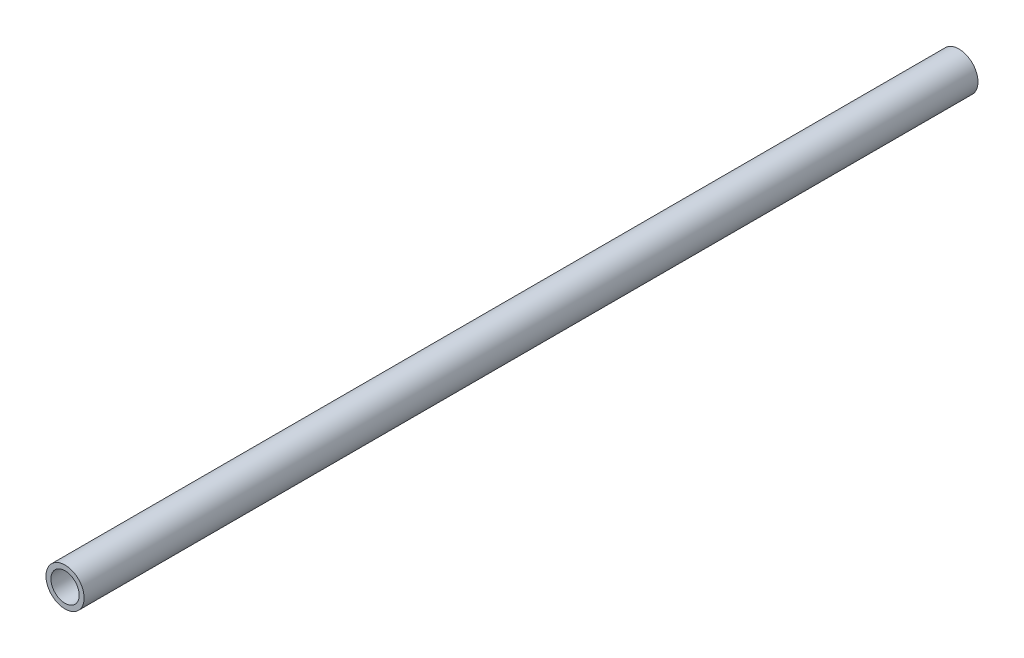
ISO-10303-21;
HEADER;
FILE_DESCRIPTION(('STEP AP214'),'2;1');
FILE_NAME('part.step','',(''),(''),'','','');
FILE_SCHEMA(('AUTOMOTIVE_DESIGN { 1 0 10303 214 1 1 1 1 }'));
ENDSEC;
DATA;
#1=APPLICATION_CONTEXT('core data for automotive mechanical design processes');
#2=APPLICATION_PROTOCOL_DEFINITION('international standard','automotive_design',2000,#1);
#3=PRODUCT_CONTEXT('',#1,'mechanical');
#4=PRODUCT('Part','Part','',(#3));
#5=PRODUCT_RELATED_PRODUCT_CATEGORY('part','',(#4));
#6=PRODUCT_DEFINITION_FORMATION('','',#4);
#7=PRODUCT_DEFINITION_CONTEXT('part definition',#1,'design');
#8=PRODUCT_DEFINITION('design','',#6,#7);
#9=PRODUCT_DEFINITION_SHAPE('','',#8);
#10=(LENGTH_UNIT() NAMED_UNIT(*) SI_UNIT(.MILLI.,.METRE.));
#11=(NAMED_UNIT(*) PLANE_ANGLE_UNIT() SI_UNIT($,.RADIAN.));
#12=(NAMED_UNIT(*) SI_UNIT($,.STERADIAN.) SOLID_ANGLE_UNIT());
#13=UNCERTAINTY_MEASURE_WITH_UNIT(LENGTH_MEASURE(1.E-05),#10,'distance_accuracy_value','');
#14=(GEOMETRIC_REPRESENTATION_CONTEXT(3) GLOBAL_UNCERTAINTY_ASSIGNED_CONTEXT((#13)) GLOBAL_UNIT_ASSIGNED_CONTEXT((#10,
#11,#12)) REPRESENTATION_CONTEXT('',''));
#15=CARTESIAN_POINT('',(0.,0.,0.));
#16=DIRECTION('',(0.,0.,1.));
#17=DIRECTION('',(1.,0.,0.));
#18=AXIS2_PLACEMENT_3D('',#15,#16,#17);
#19=CARTESIAN_POINT('',(0.,0.,250.));
#20=DIRECTION('',(0.,0.,1.));
#21=DIRECTION('',(1.,0.,0.));
#22=AXIS2_PLACEMENT_3D('',#19,#20,#21);
#23=PLANE('',#22);
#24=CARTESIAN_POINT('',(0.,0.,250.));
#25=DIRECTION('',(0.,0.,1.));
#26=DIRECTION('',(1.,0.,0.));
#27=AXIS2_PLACEMENT_3D('',#24,#25,#26);
#28=CIRCLE('',#27,10.668);
#29=CARTESIAN_POINT('',(10.668,0.,250.));
#30=VERTEX_POINT('',#29);
#31=EDGE_CURVE('E11',#30,#30,#28,.T.);
#32=ORIENTED_EDGE('',*,*,#31,.T.);
#33=EDGE_LOOP('',(#32));
#34=FACE_BOUND('',#33,.T.);
#35=CARTESIAN_POINT('',(0.,0.,250.));
#36=DIRECTION('',(0.,0.,1.));
#37=DIRECTION('',(1.,0.,0.));
#38=AXIS2_PLACEMENT_3D('',#35,#36,#37);
#39=CIRCLE('',#38,7.8994);
#40=CARTESIAN_POINT('',(7.8994,0.,250.));
#41=VERTEX_POINT('',#40);
#42=EDGE_CURVE('E48',#41,#41,#39,.T.);
#43=ORIENTED_EDGE('',*,*,#42,.F.);
#44=EDGE_LOOP('',(#43));
#45=FACE_BOUND('',#44,.T.);
#46=ADVANCED_FACE('F37',(#34,#45),#23,.T.);
#47=CARTESIAN_POINT('',(0.,0.,-250.));
#48=DIRECTION('',(0.,0.,1.));
#49=DIRECTION('',(1.,0.,0.));
#50=AXIS2_PLACEMENT_3D('',#47,#48,#49);
#51=PLANE('',#50);
#52=CARTESIAN_POINT('',(0.,0.,-250.));
#53=DIRECTION('',(0.,0.,1.));
#54=DIRECTION('',(1.,0.,0.));
#55=AXIS2_PLACEMENT_3D('',#52,#53,#54);
#56=CIRCLE('',#55,10.668);
#57=CARTESIAN_POINT('',(10.668,0.,-250.));
#58=VERTEX_POINT('',#57);
#59=EDGE_CURVE('E41',#58,#58,#56,.T.);
#60=ORIENTED_EDGE('',*,*,#59,.F.);
#61=EDGE_LOOP('',(#60));
#62=FACE_BOUND('',#61,.T.);
#63=CARTESIAN_POINT('',(0.,0.,-250.));
#64=DIRECTION('',(0.,0.,1.));
#65=DIRECTION('',(1.,0.,0.));
#66=AXIS2_PLACEMENT_3D('',#63,#64,#65);
#67=CIRCLE('',#66,7.8994);
#68=CARTESIAN_POINT('',(7.8994,0.,-250.));
#69=VERTEX_POINT('',#68);
#70=EDGE_CURVE('E50',#69,#69,#67,.T.);
#71=ORIENTED_EDGE('',*,*,#70,.T.);
#72=EDGE_LOOP('',(#71));
#73=FACE_BOUND('',#72,.T.);
#74=ADVANCED_FACE('F60',(#62,#73),#51,.F.);
#75=CARTESIAN_POINT('',(0.,0.,250.));
#76=DIRECTION('',(0.,0.,-1.));
#77=DIRECTION('',(-1.,0.,0.));
#78=AXIS2_PLACEMENT_3D('',#75,#76,#77);
#79=CYLINDRICAL_SURFACE('',#78,10.668);
#80=ORIENTED_EDGE('',*,*,#31,.F.);
#81=EDGE_LOOP('',(#80));
#82=FACE_BOUND('',#81,.T.);
#83=ORIENTED_EDGE('',*,*,#59,.T.);
#84=EDGE_LOOP('',(#83));
#85=FACE_BOUND('',#84,.T.);
#86=ADVANCED_FACE('F39',(#82,#85),#79,.T.);
#87=CARTESIAN_POINT('',(0.,0.,250.));
#88=DIRECTION('',(0.,0.,-1.));
#89=DIRECTION('',(-1.,0.,0.));
#90=AXIS2_PLACEMENT_3D('',#87,#88,#89);
#91=CYLINDRICAL_SURFACE('',#90,7.8994);
#92=ORIENTED_EDGE('',*,*,#42,.T.);
#93=EDGE_LOOP('',(#92));
#94=FACE_BOUND('',#93,.T.);
#95=ORIENTED_EDGE('',*,*,#70,.F.);
#96=EDGE_LOOP('',(#95));
#97=FACE_BOUND('',#96,.T.);
#98=ADVANCED_FACE('F56',(#94,#97),#91,.F.);
#99=CLOSED_SHELL('',(#46,#74,#86,#98));
#100=MANIFOLD_SOLID_BREP('B2',#99);
#101=ADVANCED_BREP_SHAPE_REPRESENTATION('',(#18,#100),#14);
#102=SHAPE_DEFINITION_REPRESENTATION(#9,#101);
ENDSEC;
END-ISO-10303-21;
